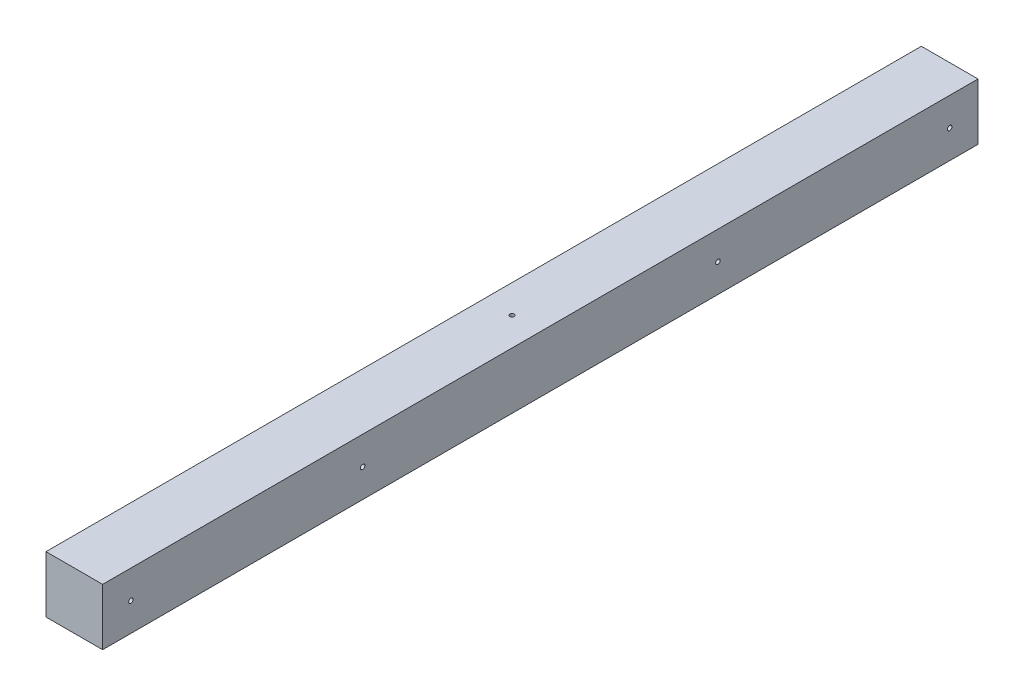
ISO-10303-21;
HEADER;
FILE_DESCRIPTION(('STEP AP214'),'2;1');
FILE_NAME('part.step','',(''),(''),'','','');
FILE_SCHEMA(('AUTOMOTIVE_DESIGN { 1 0 10303 214 1 1 1 1 }'));
ENDSEC;
DATA;
#1=APPLICATION_CONTEXT('core data for automotive mechanical design processes');
#2=APPLICATION_PROTOCOL_DEFINITION('international standard','automotive_design',2000,#1);
#3=PRODUCT_CONTEXT('',#1,'mechanical');
#4=PRODUCT('Part','Part','',(#3));
#5=PRODUCT_RELATED_PRODUCT_CATEGORY('part','',(#4));
#6=PRODUCT_DEFINITION_FORMATION('','',#4);
#7=PRODUCT_DEFINITION_CONTEXT('part definition',#1,'design');
#8=PRODUCT_DEFINITION('design','',#6,#7);
#9=PRODUCT_DEFINITION_SHAPE('','',#8);
#10=(LENGTH_UNIT() NAMED_UNIT(*) SI_UNIT(.MILLI.,.METRE.));
#11=(NAMED_UNIT(*) PLANE_ANGLE_UNIT() SI_UNIT($,.RADIAN.));
#12=(NAMED_UNIT(*) SI_UNIT($,.STERADIAN.) SOLID_ANGLE_UNIT());
#13=UNCERTAINTY_MEASURE_WITH_UNIT(LENGTH_MEASURE(1.E-05),#10,'distance_accuracy_value','');
#14=(GEOMETRIC_REPRESENTATION_CONTEXT(3) GLOBAL_UNCERTAINTY_ASSIGNED_CONTEXT((#13)) GLOBAL_UNIT_ASSIGNED_CONTEXT((#10,
#11,#12)) REPRESENTATION_CONTEXT('',''));
#15=CARTESIAN_POINT('',(0.,0.,0.));
#16=DIRECTION('',(0.,0.,1.));
#17=DIRECTION('',(1.,0.,0.));
#18=AXIS2_PLACEMENT_3D('',#15,#16,#17);
#19=CARTESIAN_POINT('',(-22.,22.,680.));
#20=DIRECTION('',(1.,0.,0.));
#21=DIRECTION('',(0.,1.,0.));
#22=AXIS2_PLACEMENT_3D('',#19,#20,#21);
#23=PLANE('',#22);
#24=CARTESIAN_POINT('',(-22.,0.,22.));
#25=DIRECTION('',(1.,0.,0.));
#26=DIRECTION('',(0.,1.,0.));
#27=AXIS2_PLACEMENT_3D('',#24,#25,#26);
#28=CIRCLE('',#27,1.75);
#29=CARTESIAN_POINT('',(-22.,1.75,22.));
#30=VERTEX_POINT('',#29);
#31=EDGE_CURVE('E135',#30,#30,#28,.T.);
#32=ORIENTED_EDGE('',*,*,#31,.T.);
#33=EDGE_LOOP('',(#32));
#34=FACE_BOUND('',#33,.T.);
#35=CARTESIAN_POINT('',(-22.,0.,478.));
#36=DIRECTION('',(1.,0.,0.));
#37=DIRECTION('',(0.,-1.,0.));
#38=AXIS2_PLACEMENT_3D('',#35,#36,#37);
#39=CIRCLE('',#38,1.75);
#40=CARTESIAN_POINT('',(-22.,-1.75,478.));
#41=VERTEX_POINT('',#40);
#42=EDGE_CURVE('E131',#41,#41,#39,.T.);
#43=ORIENTED_EDGE('',*,*,#42,.T.);
#44=EDGE_LOOP('',(#43));
#45=FACE_BOUND('',#44,.T.);
#46=CARTESIAN_POINT('',(-22.,0.,202.));
#47=DIRECTION('',(1.,0.,0.));
#48=DIRECTION('',(0.,1.,0.));
#49=AXIS2_PLACEMENT_3D('',#46,#47,#48);
#50=CIRCLE('',#49,1.75);
#51=CARTESIAN_POINT('',(-22.,1.75,202.));
#52=VERTEX_POINT('',#51);
#53=EDGE_CURVE('E124',#52,#52,#50,.T.);
#54=ORIENTED_EDGE('',*,*,#53,.T.);
#55=EDGE_LOOP('',(#54));
#56=FACE_BOUND('',#55,.T.);
#57=CARTESIAN_POINT('',(-22.,0.,658.));
#58=DIRECTION('',(1.,0.,0.));
#59=DIRECTION('',(0.,-1.,0.));
#60=AXIS2_PLACEMENT_3D('',#57,#58,#59);
#61=CIRCLE('',#60,1.74999999999998);
#62=CARTESIAN_POINT('',(-22.,-1.74999999999999,658.));
#63=VERTEX_POINT('',#62);
#64=EDGE_CURVE('E132',#63,#63,#61,.T.);
#65=ORIENTED_EDGE('',*,*,#64,.T.);
#66=EDGE_LOOP('',(#65));
#67=FACE_BOUND('',#66,.T.);
#68=DIRECTION('',(0.,-1.,0.));
#69=VECTOR('',#68,1.);
#70=CARTESIAN_POINT('',(-22.,22.,0.));
#71=LINE('',#70,#69);
#72=CARTESIAN_POINT('',(-22.,22.,0.));
#73=VERTEX_POINT('',#72);
#74=CARTESIAN_POINT('',(-22.,-22.,0.));
#75=VERTEX_POINT('',#74);
#76=EDGE_CURVE('E110',#73,#75,#71,.T.);
#77=ORIENTED_EDGE('',*,*,#76,.T.);
#78=DIRECTION('',(0.,0.,-1.));
#79=VECTOR('',#78,1.);
#80=CARTESIAN_POINT('',(-22.,-22.,680.));
#81=LINE('',#80,#79);
#82=CARTESIAN_POINT('',(-22.,-22.,680.));
#83=VERTEX_POINT('',#82);
#84=EDGE_CURVE('E11',#83,#75,#81,.T.);
#85=ORIENTED_EDGE('',*,*,#84,.F.);
#86=DIRECTION('',(0.,-1.,0.));
#87=VECTOR('',#86,1.);
#88=CARTESIAN_POINT('',(-22.,22.,680.));
#89=LINE('',#88,#87);
#90=CARTESIAN_POINT('',(-22.,22.,680.));
#91=VERTEX_POINT('',#90);
#92=EDGE_CURVE('E97',#91,#83,#89,.T.);
#93=ORIENTED_EDGE('',*,*,#92,.F.);
#94=DIRECTION('',(0.,0.,-1.));
#95=VECTOR('',#94,1.);
#96=CARTESIAN_POINT('',(-22.,22.,680.));
#97=LINE('',#96,#95);
#98=EDGE_CURVE('E106',#91,#73,#97,.T.);
#99=ORIENTED_EDGE('',*,*,#98,.T.);
#100=EDGE_LOOP('',(#77,#85,#93,#99));
#101=FACE_BOUND('',#100,.T.);
#102=ADVANCED_FACE('F45',(#34,#45,#56,#67,#101),#23,.F.);
#103=CARTESIAN_POINT('',(22.,-22.,680.));
#104=DIRECTION('',(0.,1.,0.));
#105=DIRECTION('',(-1.,0.,0.));
#106=AXIS2_PLACEMENT_3D('',#103,#104,#105);
#107=PLANE('',#106);
#108=CARTESIAN_POINT('',(0.,-22.,340.));
#109=DIRECTION('',(0.,-1.,0.));
#110=DIRECTION('',(1.,0.,0.));
#111=AXIS2_PLACEMENT_3D('',#108,#109,#110);
#112=CIRCLE('',#111,1.75);
#113=CARTESIAN_POINT('',(1.75,-22.,340.));
#114=VERTEX_POINT('',#113);
#115=EDGE_CURVE('E147',#114,#114,#112,.T.);
#116=ORIENTED_EDGE('',*,*,#115,.F.);
#117=EDGE_LOOP('',(#116));
#118=FACE_BOUND('',#117,.T.);
#119=DIRECTION('',(1.,0.,0.));
#120=VECTOR('',#119,1.);
#121=CARTESIAN_POINT('',(22.,-22.,0.));
#122=LINE('',#121,#120);
#123=CARTESIAN_POINT('',(22.,-22.,0.));
#124=VERTEX_POINT('',#123);
#125=EDGE_CURVE('E101',#75,#124,#122,.T.);
#126=ORIENTED_EDGE('',*,*,#125,.T.);
#127=DIRECTION('',(0.,0.,-1.));
#128=VECTOR('',#127,1.);
#129=CARTESIAN_POINT('',(22.,-22.,680.));
#130=LINE('',#129,#128);
#131=CARTESIAN_POINT('',(22.,-22.,680.));
#132=VERTEX_POINT('',#131);
#133=EDGE_CURVE('E54',#132,#124,#130,.T.);
#134=ORIENTED_EDGE('',*,*,#133,.F.);
#135=DIRECTION('',(1.,0.,0.));
#136=VECTOR('',#135,1.);
#137=CARTESIAN_POINT('',(22.,-22.,680.));
#138=LINE('',#137,#136);
#139=EDGE_CURVE('E92',#83,#132,#138,.T.);
#140=ORIENTED_EDGE('',*,*,#139,.F.);
#141=ORIENTED_EDGE('',*,*,#84,.T.);
#142=EDGE_LOOP('',(#126,#134,#140,#141));
#143=FACE_BOUND('',#142,.T.);
#144=ADVANCED_FACE('F100',(#118,#143),#107,.F.);
#145=CARTESIAN_POINT('',(22.,22.,680.));
#146=DIRECTION('',(-1.,0.,0.));
#147=DIRECTION('',(0.,-1.,0.));
#148=AXIS2_PLACEMENT_3D('',#145,#146,#147);
#149=PLANE('',#148);
#150=CARTESIAN_POINT('',(22.,0.,22.));
#151=DIRECTION('',(-1.,0.,0.));
#152=DIRECTION('',(0.,-1.,0.));
#153=AXIS2_PLACEMENT_3D('',#150,#151,#152);
#154=CIRCLE('',#153,1.75);
#155=CARTESIAN_POINT('',(22.,-1.75,22.));
#156=VERTEX_POINT('',#155);
#157=EDGE_CURVE('E113',#156,#156,#154,.T.);
#158=ORIENTED_EDGE('',*,*,#157,.T.);
#159=EDGE_LOOP('',(#158));
#160=FACE_BOUND('',#159,.T.);
#161=CARTESIAN_POINT('',(22.,0.,478.));
#162=DIRECTION('',(-1.,0.,0.));
#163=DIRECTION('',(0.,-1.,0.));
#164=AXIS2_PLACEMENT_3D('',#161,#162,#163);
#165=CIRCLE('',#164,1.75);
#166=CARTESIAN_POINT('',(22.,-1.75,478.));
#167=VERTEX_POINT('',#166);
#168=EDGE_CURVE('E140',#167,#167,#165,.T.);
#169=ORIENTED_EDGE('',*,*,#168,.T.);
#170=EDGE_LOOP('',(#169));
#171=FACE_BOUND('',#170,.T.);
#172=CARTESIAN_POINT('',(22.,0.,202.));
#173=DIRECTION('',(-1.,0.,0.));
#174=DIRECTION('',(0.,-1.,0.));
#175=AXIS2_PLACEMENT_3D('',#172,#173,#174);
#176=CIRCLE('',#175,1.75);
#177=CARTESIAN_POINT('',(22.,-1.75,202.));
#178=VERTEX_POINT('',#177);
#179=EDGE_CURVE('E128',#178,#178,#176,.T.);
#180=ORIENTED_EDGE('',*,*,#179,.T.);
#181=EDGE_LOOP('',(#180));
#182=FACE_BOUND('',#181,.T.);
#183=CARTESIAN_POINT('',(22.,0.,658.));
#184=DIRECTION('',(-1.,0.,0.));
#185=DIRECTION('',(0.,-1.,0.));
#186=AXIS2_PLACEMENT_3D('',#183,#184,#185);
#187=CIRCLE('',#186,1.74999999999998);
#188=CARTESIAN_POINT('',(22.,-1.74999999999998,658.));
#189=VERTEX_POINT('',#188);
#190=EDGE_CURVE('E127',#189,#189,#187,.T.);
#191=ORIENTED_EDGE('',*,*,#190,.T.);
#192=EDGE_LOOP('',(#191));
#193=FACE_BOUND('',#192,.T.);
#194=DIRECTION('',(0.,1.,0.));
#195=VECTOR('',#194,1.);
#196=CARTESIAN_POINT('',(22.,22.,0.));
#197=LINE('',#196,#195);
#198=CARTESIAN_POINT('',(22.,22.,0.));
#199=VERTEX_POINT('',#198);
#200=EDGE_CURVE('E79',#124,#199,#197,.T.);
#201=ORIENTED_EDGE('',*,*,#200,.T.);
#202=DIRECTION('',(0.,0.,-1.));
#203=VECTOR('',#202,1.);
#204=CARTESIAN_POINT('',(22.,22.,680.));
#205=LINE('',#204,#203);
#206=CARTESIAN_POINT('',(22.,22.,680.));
#207=VERTEX_POINT('',#206);
#208=EDGE_CURVE('E102',#207,#199,#205,.T.);
#209=ORIENTED_EDGE('',*,*,#208,.F.);
#210=DIRECTION('',(0.,1.,0.));
#211=VECTOR('',#210,1.);
#212=CARTESIAN_POINT('',(22.,22.,680.));
#213=LINE('',#212,#211);
#214=EDGE_CURVE('E95',#132,#207,#213,.T.);
#215=ORIENTED_EDGE('',*,*,#214,.F.);
#216=ORIENTED_EDGE('',*,*,#133,.T.);
#217=EDGE_LOOP('',(#201,#209,#215,#216));
#218=FACE_BOUND('',#217,.T.);
#219=ADVANCED_FACE('F104',(#160,#171,#182,#193,#218),#149,.F.);
#220=CARTESIAN_POINT('',(22.,22.,680.));
#221=DIRECTION('',(0.,-1.,0.));
#222=DIRECTION('',(1.,0.,0.));
#223=AXIS2_PLACEMENT_3D('',#220,#221,#222);
#224=PLANE('',#223);
#225=CARTESIAN_POINT('',(0.,22.,340.));
#226=DIRECTION('',(0.,-1.,0.));
#227=DIRECTION('',(1.,0.,0.));
#228=AXIS2_PLACEMENT_3D('',#225,#226,#227);
#229=CIRCLE('',#228,1.75);
#230=CARTESIAN_POINT('',(1.75,22.,340.));
#231=VERTEX_POINT('',#230);
#232=EDGE_CURVE('E48',#231,#231,#229,.T.);
#233=ORIENTED_EDGE('',*,*,#232,.T.);
#234=EDGE_LOOP('',(#233));
#235=FACE_BOUND('',#234,.T.);
#236=DIRECTION('',(-1.,0.,0.));
#237=VECTOR('',#236,1.);
#238=CARTESIAN_POINT('',(22.,22.,0.));
#239=LINE('',#238,#237);
#240=EDGE_CURVE('E85',#199,#73,#239,.T.);
#241=ORIENTED_EDGE('',*,*,#240,.T.);
#242=ORIENTED_EDGE('',*,*,#98,.F.);
#243=DIRECTION('',(-1.,0.,0.));
#244=VECTOR('',#243,1.);
#245=CARTESIAN_POINT('',(22.,22.,680.));
#246=LINE('',#245,#244);
#247=EDGE_CURVE('E62',#207,#91,#246,.T.);
#248=ORIENTED_EDGE('',*,*,#247,.F.);
#249=ORIENTED_EDGE('',*,*,#208,.T.);
#250=EDGE_LOOP('',(#241,#242,#248,#249));
#251=FACE_BOUND('',#250,.T.);
#252=ADVANCED_FACE('F118',(#235,#251),#224,.F.);
#253=CARTESIAN_POINT('',(0.,0.,680.));
#254=DIRECTION('',(0.,0.,-1.));
#255=DIRECTION('',(-1.,0.,0.));
#256=AXIS2_PLACEMENT_3D('',#253,#254,#255);
#257=PLANE('',#256);
#258=ORIENTED_EDGE('',*,*,#92,.T.);
#259=ORIENTED_EDGE('',*,*,#139,.T.);
#260=ORIENTED_EDGE('',*,*,#214,.T.);
#261=ORIENTED_EDGE('',*,*,#247,.T.);
#262=EDGE_LOOP('',(#258,#259,#260,#261));
#263=FACE_BOUND('',#262,.T.);
#264=ADVANCED_FACE('F93',(#263),#257,.F.);
#265=CARTESIAN_POINT('',(0.,0.,0.));
#266=DIRECTION('',(0.,0.,-1.));
#267=DIRECTION('',(-1.,0.,0.));
#268=AXIS2_PLACEMENT_3D('',#265,#266,#267);
#269=PLANE('',#268);
#270=ORIENTED_EDGE('',*,*,#76,.F.);
#271=ORIENTED_EDGE('',*,*,#240,.F.);
#272=ORIENTED_EDGE('',*,*,#200,.F.);
#273=ORIENTED_EDGE('',*,*,#125,.F.);
#274=EDGE_LOOP('',(#270,#271,#272,#273));
#275=FACE_BOUND('',#274,.T.);
#276=ADVANCED_FACE('F121',(#275),#269,.T.);
#277=CARTESIAN_POINT('',(26.9497474683059,0.,658.));
#278=DIRECTION('',(-1.,0.,0.));
#279=DIRECTION('',(0.,-1.,0.));
#280=AXIS2_PLACEMENT_3D('',#277,#278,#279);
#281=CYLINDRICAL_SURFACE('',#280,1.74999999999998);
#282=ORIENTED_EDGE('',*,*,#190,.F.);
#283=EDGE_LOOP('',(#282));
#284=FACE_BOUND('',#283,.T.);
#285=ORIENTED_EDGE('',*,*,#64,.F.);
#286=EDGE_LOOP('',(#285));
#287=FACE_BOUND('',#286,.T.);
#288=ADVANCED_FACE('F182',(#284,#287),#281,.F.);
#289=CARTESIAN_POINT('',(26.9497474683059,0.,202.));
#290=DIRECTION('',(-1.,0.,0.));
#291=DIRECTION('',(0.,-1.,0.));
#292=AXIS2_PLACEMENT_3D('',#289,#290,#291);
#293=CYLINDRICAL_SURFACE('',#292,1.75);
#294=ORIENTED_EDGE('',*,*,#179,.F.);
#295=EDGE_LOOP('',(#294));
#296=FACE_BOUND('',#295,.T.);
#297=ORIENTED_EDGE('',*,*,#53,.F.);
#298=EDGE_LOOP('',(#297));
#299=FACE_BOUND('',#298,.T.);
#300=ADVANCED_FACE('F184',(#296,#299),#293,.F.);
#301=CARTESIAN_POINT('',(26.9497474683059,0.,478.));
#302=DIRECTION('',(-1.,0.,0.));
#303=DIRECTION('',(0.,-1.,0.));
#304=AXIS2_PLACEMENT_3D('',#301,#302,#303);
#305=CYLINDRICAL_SURFACE('',#304,1.75);
#306=ORIENTED_EDGE('',*,*,#168,.F.);
#307=EDGE_LOOP('',(#306));
#308=FACE_BOUND('',#307,.T.);
#309=ORIENTED_EDGE('',*,*,#42,.F.);
#310=EDGE_LOOP('',(#309));
#311=FACE_BOUND('',#310,.T.);
#312=ADVANCED_FACE('F163',(#308,#311),#305,.F.);
#313=CARTESIAN_POINT('',(26.9497474683059,0.,22.));
#314=DIRECTION('',(-1.,0.,0.));
#315=DIRECTION('',(0.,-1.,0.));
#316=AXIS2_PLACEMENT_3D('',#313,#314,#315);
#317=CYLINDRICAL_SURFACE('',#316,1.75);
#318=ORIENTED_EDGE('',*,*,#157,.F.);
#319=EDGE_LOOP('',(#318));
#320=FACE_BOUND('',#319,.T.);
#321=ORIENTED_EDGE('',*,*,#31,.F.);
#322=EDGE_LOOP('',(#321));
#323=FACE_BOUND('',#322,.T.);
#324=ADVANCED_FACE('F157',(#320,#323),#317,.F.);
#325=CARTESIAN_POINT('',(0.,38.,340.));
#326=DIRECTION('',(0.,-1.,0.));
#327=DIRECTION('',(1.,0.,0.));
#328=AXIS2_PLACEMENT_3D('',#325,#326,#327);
#329=CYLINDRICAL_SURFACE('',#328,1.75);
#330=ORIENTED_EDGE('',*,*,#115,.T.);
#331=EDGE_LOOP('',(#330));
#332=FACE_BOUND('',#331,.T.);
#333=ORIENTED_EDGE('',*,*,#232,.F.);
#334=EDGE_LOOP('',(#333));
#335=FACE_BOUND('',#334,.T.);
#336=ADVANCED_FACE('F155',(#332,#335),#329,.F.);
#337=CLOSED_SHELL('',(#102,#144,#219,#252,#264,#276,#288,#300,#312,#324,#336));
#338=MANIFOLD_SOLID_BREP('B2',#337);
#339=ADVANCED_BREP_SHAPE_REPRESENTATION('',(#18,#338),#14);
#340=SHAPE_DEFINITION_REPRESENTATION(#9,#339);
ENDSEC;
END-ISO-10303-21;
